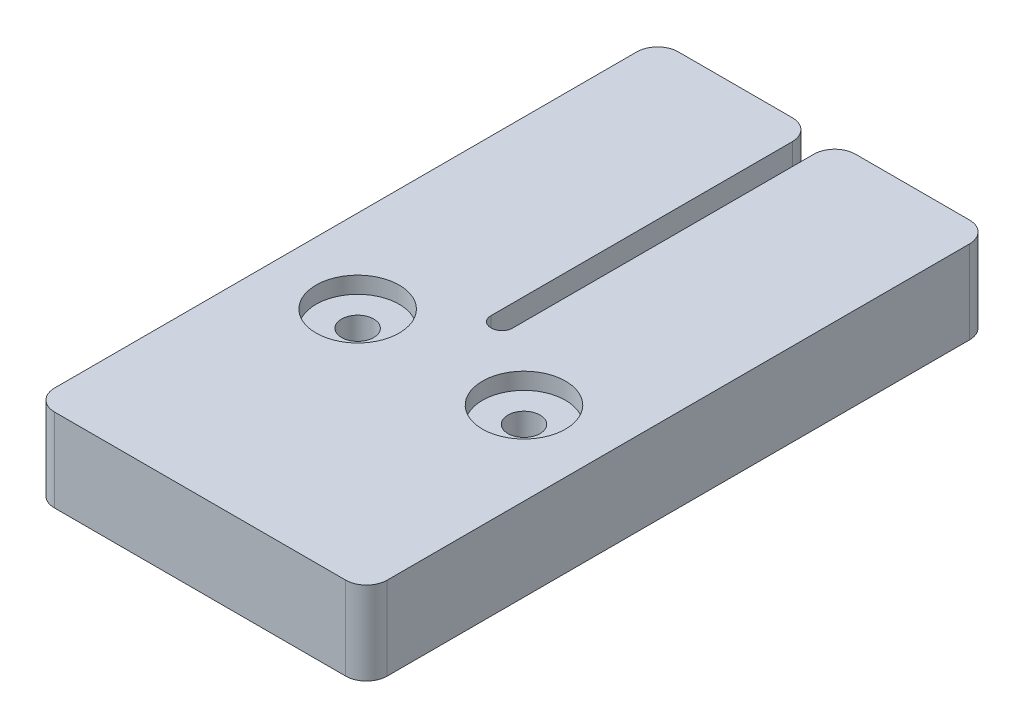
ISO-10303-21;
HEADER;
FILE_DESCRIPTION(('STEP AP214'),'2;1');
FILE_NAME('part.step','',(''),(''),'','','');
FILE_SCHEMA(('AUTOMOTIVE_DESIGN { 1 0 10303 214 1 1 1 1 }'));
ENDSEC;
DATA;
#1=APPLICATION_CONTEXT('core data for automotive mechanical design processes');
#2=APPLICATION_PROTOCOL_DEFINITION('international standard','automotive_design',2000,#1);
#3=PRODUCT_CONTEXT('',#1,'mechanical');
#4=PRODUCT('Part','Part','',(#3));
#5=PRODUCT_RELATED_PRODUCT_CATEGORY('part','',(#4));
#6=PRODUCT_DEFINITION_FORMATION('','',#4);
#7=PRODUCT_DEFINITION_CONTEXT('part definition',#1,'design');
#8=PRODUCT_DEFINITION('design','',#6,#7);
#9=PRODUCT_DEFINITION_SHAPE('','',#8);
#10=(LENGTH_UNIT() NAMED_UNIT(*) SI_UNIT(.MILLI.,.METRE.));
#11=(NAMED_UNIT(*) PLANE_ANGLE_UNIT() SI_UNIT($,.RADIAN.));
#12=(NAMED_UNIT(*) SI_UNIT($,.STERADIAN.) SOLID_ANGLE_UNIT());
#13=UNCERTAINTY_MEASURE_WITH_UNIT(LENGTH_MEASURE(1.E-05),#10,'distance_accuracy_value','');
#14=(GEOMETRIC_REPRESENTATION_CONTEXT(3) GLOBAL_UNCERTAINTY_ASSIGNED_CONTEXT((#13)) GLOBAL_UNIT_ASSIGNED_CONTEXT((#10,
#11,#12)) REPRESENTATION_CONTEXT('',''));
#15=CARTESIAN_POINT('',(0.,0.,0.));
#16=DIRECTION('',(0.,0.,1.));
#17=DIRECTION('',(1.,0.,0.));
#18=AXIS2_PLACEMENT_3D('',#15,#16,#17);
#19=CARTESIAN_POINT('',(12.7,12.7,-36.7538));
#20=DIRECTION('',(0.,-1.,0.));
#21=DIRECTION('',(0.,0.,-1.));
#22=AXIS2_PLACEMENT_3D('',#19,#20,#21);
#23=CYLINDRICAL_SURFACE('',#22,2.45745);
#24=CARTESIAN_POINT('',(12.7,0.,-36.7538));
#25=DIRECTION('',(0.,-1.,0.));
#26=DIRECTION('',(0.,0.,-1.));
#27=AXIS2_PLACEMENT_3D('',#24,#25,#26);
#28=CIRCLE('',#27,2.45745);
#29=CARTESIAN_POINT('',(12.7,0.,-39.21125));
#30=VERTEX_POINT('',#29);
#31=EDGE_CURVE('E297',#30,#30,#28,.T.);
#32=ORIENTED_EDGE('',*,*,#31,.T.);
#33=EDGE_LOOP('',(#32));
#34=FACE_BOUND('',#33,.T.);
#35=CARTESIAN_POINT('',(12.7,10.16,-36.7538));
#36=DIRECTION('',(0.,1.,0.));
#37=DIRECTION('',(0.,0.,1.));
#38=AXIS2_PLACEMENT_3D('',#35,#36,#37);
#39=CIRCLE('',#38,2.45745);
#40=CARTESIAN_POINT('',(12.7,10.16,-34.29635));
#41=VERTEX_POINT('',#40);
#42=EDGE_CURVE('E45',#41,#41,#39,.F.);
#43=ORIENTED_EDGE('',*,*,#42,.F.);
#44=EDGE_LOOP('',(#43));
#45=FACE_BOUND('',#44,.T.);
#46=ADVANCED_FACE('F41',(#34,#45),#23,.F.);
#47=CARTESIAN_POINT('',(-12.7,12.7,-36.7538));
#48=DIRECTION('',(0.,-1.,0.));
#49=DIRECTION('',(0.,0.,-1.));
#50=AXIS2_PLACEMENT_3D('',#47,#48,#49);
#51=CYLINDRICAL_SURFACE('',#50,2.45745);
#52=CARTESIAN_POINT('',(-12.7,0.,-36.7538));
#53=DIRECTION('',(0.,-1.,0.));
#54=DIRECTION('',(0.,0.,-1.));
#55=AXIS2_PLACEMENT_3D('',#52,#53,#54);
#56=CIRCLE('',#55,2.45745);
#57=CARTESIAN_POINT('',(-12.7,0.,-39.21125));
#58=VERTEX_POINT('',#57);
#59=EDGE_CURVE('E316',#58,#58,#56,.T.);
#60=ORIENTED_EDGE('',*,*,#59,.T.);
#61=EDGE_LOOP('',(#60));
#62=FACE_BOUND('',#61,.T.);
#63=CARTESIAN_POINT('',(-12.7,10.16,-36.7538));
#64=DIRECTION('',(0.,1.,0.));
#65=DIRECTION('',(0.,0.,1.));
#66=AXIS2_PLACEMENT_3D('',#63,#64,#65);
#67=CIRCLE('',#66,2.45745);
#68=CARTESIAN_POINT('',(-12.7,10.16,-34.29635));
#69=VERTEX_POINT('',#68);
#70=EDGE_CURVE('E287',#69,#69,#67,.F.);
#71=ORIENTED_EDGE('',*,*,#70,.F.);
#72=EDGE_LOOP('',(#71));
#73=FACE_BOUND('',#72,.T.);
#74=ADVANCED_FACE('F386',(#62,#73),#51,.F.);
#75=CARTESIAN_POINT('',(-25.4,12.7,-95.25));
#76=DIRECTION('',(1.,0.,0.));
#77=DIRECTION('',(0.,0.,-1.));
#78=AXIS2_PLACEMENT_3D('',#75,#76,#77);
#79=PLANE('',#78);
#80=DIRECTION('',(0.,0.,1.));
#81=VECTOR('',#80,1.);
#82=CARTESIAN_POINT('',(-25.4,12.7,-95.25));
#83=LINE('',#82,#81);
#84=CARTESIAN_POINT('',(-25.4,12.7,-92.075));
#85=VERTEX_POINT('',#84);
#86=CARTESIAN_POINT('',(-25.4,12.7,-3.175));
#87=VERTEX_POINT('',#86);
#88=EDGE_CURVE('E196',#85,#87,#83,.T.);
#89=ORIENTED_EDGE('',*,*,#88,.F.);
#90=DIRECTION('',(0.,-1.,0.));
#91=VECTOR('',#90,1.);
#92=CARTESIAN_POINT('',(-25.4,12.7,-92.075));
#93=LINE('',#92,#91);
#94=CARTESIAN_POINT('',(-25.4,0.,-92.075));
#95=VERTEX_POINT('',#94);
#96=EDGE_CURVE('E249',#85,#95,#93,.T.);
#97=ORIENTED_EDGE('',*,*,#96,.T.);
#98=DIRECTION('',(0.,0.,1.));
#99=VECTOR('',#98,1.);
#100=CARTESIAN_POINT('',(-25.4,0.,-95.25));
#101=LINE('',#100,#99);
#102=CARTESIAN_POINT('',(-25.4,0.,-3.175));
#103=VERTEX_POINT('',#102);
#104=EDGE_CURVE('E320',#95,#103,#101,.T.);
#105=ORIENTED_EDGE('',*,*,#104,.T.);
#106=DIRECTION('',(0.,-1.,0.));
#107=VECTOR('',#106,1.);
#108=CARTESIAN_POINT('',(-25.4,12.7,-3.175));
#109=LINE('',#108,#107);
#110=EDGE_CURVE('E246',#103,#87,#109,.F.);
#111=ORIENTED_EDGE('',*,*,#110,.T.);
#112=EDGE_LOOP('',(#89,#97,#105,#111));
#113=FACE_BOUND('',#112,.T.);
#114=ADVANCED_FACE('F392',(#113),#79,.F.);
#115=CARTESIAN_POINT('',(-25.4,12.7,0.));
#116=DIRECTION('',(0.,0.,-1.));
#117=DIRECTION('',(-1.,0.,0.));
#118=AXIS2_PLACEMENT_3D('',#115,#116,#117);
#119=PLANE('',#118);
#120=DIRECTION('',(1.,0.,0.));
#121=VECTOR('',#120,1.);
#122=CARTESIAN_POINT('',(-25.4,12.7,0.));
#123=LINE('',#122,#121);
#124=CARTESIAN_POINT('',(-22.225,12.7,0.));
#125=VERTEX_POINT('',#124);
#126=CARTESIAN_POINT('',(22.225,12.7,0.));
#127=VERTEX_POINT('',#126);
#128=EDGE_CURVE('E327',#125,#127,#123,.T.);
#129=ORIENTED_EDGE('',*,*,#128,.F.);
#130=DIRECTION('',(0.,-1.,0.));
#131=VECTOR('',#130,1.);
#132=CARTESIAN_POINT('',(-22.225,12.7,0.));
#133=LINE('',#132,#131);
#134=CARTESIAN_POINT('',(-22.225,0.,0.));
#135=VERTEX_POINT('',#134);
#136=EDGE_CURVE('E263',#125,#135,#133,.T.);
#137=ORIENTED_EDGE('',*,*,#136,.T.);
#138=DIRECTION('',(1.,0.,0.));
#139=VECTOR('',#138,1.);
#140=CARTESIAN_POINT('',(-25.4,0.,0.));
#141=LINE('',#140,#139);
#142=CARTESIAN_POINT('',(22.225,0.,0.));
#143=VERTEX_POINT('',#142);
#144=EDGE_CURVE('E354',#135,#143,#141,.T.);
#145=ORIENTED_EDGE('',*,*,#144,.T.);
#146=DIRECTION('',(0.,-1.,0.));
#147=VECTOR('',#146,1.);
#148=CARTESIAN_POINT('',(22.225,12.7,0.));
#149=LINE('',#148,#147);
#150=EDGE_CURVE('E260',#143,#127,#149,.F.);
#151=ORIENTED_EDGE('',*,*,#150,.T.);
#152=EDGE_LOOP('',(#129,#137,#145,#151));
#153=FACE_BOUND('',#152,.T.);
#154=ADVANCED_FACE('F383',(#153),#119,.F.);
#155=CARTESIAN_POINT('',(25.4,12.7,0.));
#156=DIRECTION('',(-1.,0.,0.));
#157=DIRECTION('',(0.,0.,1.));
#158=AXIS2_PLACEMENT_3D('',#155,#156,#157);
#159=PLANE('',#158);
#160=DIRECTION('',(0.,0.,-1.));
#161=VECTOR('',#160,1.);
#162=CARTESIAN_POINT('',(25.4,0.,0.));
#163=LINE('',#162,#161);
#164=CARTESIAN_POINT('',(25.4,0.,-3.175));
#165=VERTEX_POINT('',#164);
#166=CARTESIAN_POINT('',(25.4,0.,-92.075));
#167=VERTEX_POINT('',#166);
#168=EDGE_CURVE('E187',#165,#167,#163,.T.);
#169=ORIENTED_EDGE('',*,*,#168,.T.);
#170=DIRECTION('',(0.,-1.,0.));
#171=VECTOR('',#170,1.);
#172=CARTESIAN_POINT('',(25.4,12.7,-92.075));
#173=LINE('',#172,#171);
#174=CARTESIAN_POINT('',(25.4,12.7,-92.075));
#175=VERTEX_POINT('',#174);
#176=EDGE_CURVE('E257',#167,#175,#173,.F.);
#177=ORIENTED_EDGE('',*,*,#176,.T.);
#178=DIRECTION('',(0.,0.,-1.));
#179=VECTOR('',#178,1.);
#180=CARTESIAN_POINT('',(25.4,12.7,0.));
#181=LINE('',#180,#179);
#182=CARTESIAN_POINT('',(25.4,12.7,-3.175));
#183=VERTEX_POINT('',#182);
#184=EDGE_CURVE('E331',#183,#175,#181,.T.);
#185=ORIENTED_EDGE('',*,*,#184,.F.);
#186=DIRECTION('',(0.,-1.,0.));
#187=VECTOR('',#186,1.);
#188=CARTESIAN_POINT('',(25.4,12.7,-3.175));
#189=LINE('',#188,#187);
#190=EDGE_CURVE('E253',#183,#165,#189,.T.);
#191=ORIENTED_EDGE('',*,*,#190,.T.);
#192=EDGE_LOOP('',(#169,#177,#185,#191));
#193=FACE_BOUND('',#192,.T.);
#194=ADVANCED_FACE('F363',(#193),#159,.F.);
#195=CARTESIAN_POINT('',(25.4,12.7,-95.25));
#196=DIRECTION('',(0.,0.,1.));
#197=DIRECTION('',(1.,0.,0.));
#198=AXIS2_PLACEMENT_3D('',#195,#196,#197);
#199=PLANE('',#198);
#200=DIRECTION('',(-1.,0.,0.));
#201=VECTOR('',#200,1.);
#202=CARTESIAN_POINT('',(25.4,0.,-95.25));
#203=LINE('',#202,#201);
#204=CARTESIAN_POINT('',(22.225,0.,-95.25));
#205=VERTEX_POINT('',#204);
#206=CARTESIAN_POINT('',(4.826,0.,-95.25));
#207=VERTEX_POINT('',#206);
#208=EDGE_CURVE('E179',#205,#207,#203,.T.);
#209=ORIENTED_EDGE('',*,*,#208,.T.);
#210=DIRECTION('',(0.,-1.,0.));
#211=VECTOR('',#210,1.);
#212=CARTESIAN_POINT('',(4.826,12.7,-95.25));
#213=LINE('',#212,#211);
#214=CARTESIAN_POINT('',(4.826,12.7,-95.25));
#215=VERTEX_POINT('',#214);
#216=EDGE_CURVE('E162',#207,#215,#213,.F.);
#217=ORIENTED_EDGE('',*,*,#216,.T.);
#218=DIRECTION('',(-1.,0.,0.));
#219=VECTOR('',#218,1.);
#220=CARTESIAN_POINT('',(25.4,12.7,-95.25));
#221=LINE('',#220,#219);
#222=CARTESIAN_POINT('',(22.225,12.7,-95.25));
#223=VERTEX_POINT('',#222);
#224=EDGE_CURVE('E335',#223,#215,#221,.T.);
#225=ORIENTED_EDGE('',*,*,#224,.F.);
#226=DIRECTION('',(0.,-1.,0.));
#227=VECTOR('',#226,1.);
#228=CARTESIAN_POINT('',(22.225,12.7,-95.25));
#229=LINE('',#228,#227);
#230=EDGE_CURVE('E166',#223,#205,#229,.T.);
#231=ORIENTED_EDGE('',*,*,#230,.T.);
#232=EDGE_LOOP('',(#209,#217,#225,#231));
#233=FACE_BOUND('',#232,.T.);
#234=ADVANCED_FACE('F374',(#233),#199,.F.);
#235=CARTESIAN_POINT('',(1.65099999999999,12.7,-44.45));
#236=DIRECTION('',(1.,0.,0.));
#237=DIRECTION('',(0.,0.,-1.));
#238=AXIS2_PLACEMENT_3D('',#235,#236,#237);
#239=PLANE('',#238);
#240=DIRECTION('',(0.,0.,1.));
#241=VECTOR('',#240,1.);
#242=CARTESIAN_POINT('',(1.65099999999999,0.,-44.45));
#243=LINE('',#242,#241);
#244=CARTESIAN_POINT('',(1.651,0.,-92.075));
#245=VERTEX_POINT('',#244);
#246=CARTESIAN_POINT('',(1.65099999999999,0.,-46.0375));
#247=VERTEX_POINT('',#246);
#248=EDGE_CURVE('E170',#245,#247,#243,.T.);
#249=ORIENTED_EDGE('',*,*,#248,.T.);
#250=DIRECTION('',(0.,-1.,0.));
#251=VECTOR('',#250,1.);
#252=CARTESIAN_POINT('',(1.65099999999999,12.7,-46.0375));
#253=LINE('',#252,#251);
#254=CARTESIAN_POINT('',(1.65099999999999,12.7,-46.0375));
#255=VERTEX_POINT('',#254);
#256=EDGE_CURVE('E65',#247,#255,#253,.F.);
#257=ORIENTED_EDGE('',*,*,#256,.T.);
#258=DIRECTION('',(0.,0.,1.));
#259=VECTOR('',#258,1.);
#260=CARTESIAN_POINT('',(1.65099999999999,12.7,-44.45));
#261=LINE('',#260,#259);
#262=CARTESIAN_POINT('',(1.651,12.7,-92.075));
#263=VERTEX_POINT('',#262);
#264=EDGE_CURVE('E171',#263,#255,#261,.T.);
#265=ORIENTED_EDGE('',*,*,#264,.F.);
#266=DIRECTION('',(0.,-1.,0.));
#267=VECTOR('',#266,1.);
#268=CARTESIAN_POINT('',(1.651,12.7,-92.075));
#269=LINE('',#268,#267);
#270=EDGE_CURVE('E161',#263,#245,#269,.T.);
#271=ORIENTED_EDGE('',*,*,#270,.T.);
#272=EDGE_LOOP('',(#249,#257,#265,#271));
#273=FACE_BOUND('',#272,.T.);
#274=ADVANCED_FACE('F169',(#273),#239,.F.);
#275=CARTESIAN_POINT('',(-1.65099999999999,12.7,-44.45));
#276=DIRECTION('',(0.,0.,1.));
#277=DIRECTION('',(1.,0.,0.));
#278=AXIS2_PLACEMENT_3D('',#275,#276,#277);
#279=PLANE('',#278);
#280=DIRECTION('',(-1.,0.,0.));
#281=VECTOR('',#280,1.);
#282=CARTESIAN_POINT('',(-1.65099999999999,0.,-44.45));
#283=LINE('',#282,#281);
#284=CARTESIAN_POINT('',(0.0634999999999939,0.,-44.45));
#285=VERTEX_POINT('',#284);
#286=CARTESIAN_POINT('',(-0.0634999999999939,0.,-44.45));
#287=VERTEX_POINT('',#286);
#288=EDGE_CURVE('E178',#285,#287,#283,.T.);
#289=ORIENTED_EDGE('',*,*,#288,.T.);
#290=DIRECTION('',(0.,-1.,0.));
#291=VECTOR('',#290,1.);
#292=CARTESIAN_POINT('',(-0.0634999999999939,12.7,-44.45));
#293=LINE('',#292,#291);
#294=CARTESIAN_POINT('',(-0.0634999999999939,12.7,-44.45));
#295=VERTEX_POINT('',#294);
#296=EDGE_CURVE('E275',#287,#295,#293,.F.);
#297=ORIENTED_EDGE('',*,*,#296,.T.);
#298=DIRECTION('',(-1.,0.,0.));
#299=VECTOR('',#298,1.);
#300=CARTESIAN_POINT('',(-1.65099999999999,12.7,-44.45));
#301=LINE('',#300,#299);
#302=CARTESIAN_POINT('',(0.0634999999999939,12.7,-44.45));
#303=VERTEX_POINT('',#302);
#304=EDGE_CURVE('E341',#303,#295,#301,.T.);
#305=ORIENTED_EDGE('',*,*,#304,.F.);
#306=DIRECTION('',(0.,-1.,0.));
#307=VECTOR('',#306,1.);
#308=CARTESIAN_POINT('',(0.0634999999999939,0.,-44.45));
#309=LINE('',#308,#307);
#310=EDGE_CURVE('E271',#303,#285,#309,.T.);
#311=ORIENTED_EDGE('',*,*,#310,.T.);
#312=EDGE_LOOP('',(#289,#297,#305,#311));
#313=FACE_BOUND('',#312,.T.);
#314=ADVANCED_FACE('F381',(#313),#279,.F.);
#315=CARTESIAN_POINT('',(-1.651,12.7,-95.25));
#316=DIRECTION('',(-1.,0.,0.));
#317=DIRECTION('',(0.,0.,1.));
#318=AXIS2_PLACEMENT_3D('',#315,#316,#317);
#319=PLANE('',#318);
#320=DIRECTION('',(0.,0.,-1.));
#321=VECTOR('',#320,1.);
#322=CARTESIAN_POINT('',(-1.651,12.7,-95.25));
#323=LINE('',#322,#321);
#324=CARTESIAN_POINT('',(-1.65099999999999,12.7,-46.0375));
#325=VERTEX_POINT('',#324);
#326=CARTESIAN_POINT('',(-1.651,12.7,-92.075));
#327=VERTEX_POINT('',#326);
#328=EDGE_CURVE('E345',#325,#327,#323,.T.);
#329=ORIENTED_EDGE('',*,*,#328,.F.);
#330=DIRECTION('',(0.,-1.,0.));
#331=VECTOR('',#330,1.);
#332=CARTESIAN_POINT('',(-1.65099999999999,0.,-46.0375));
#333=LINE('',#332,#331);
#334=CARTESIAN_POINT('',(-1.65099999999999,0.,-46.0375));
#335=VERTEX_POINT('',#334);
#336=EDGE_CURVE('E267',#325,#335,#333,.T.);
#337=ORIENTED_EDGE('',*,*,#336,.T.);
#338=DIRECTION('',(0.,0.,-1.));
#339=VECTOR('',#338,1.);
#340=CARTESIAN_POINT('',(-1.651,0.,-95.25));
#341=LINE('',#340,#339);
#342=CARTESIAN_POINT('',(-1.651,0.,-92.075));
#343=VERTEX_POINT('',#342);
#344=EDGE_CURVE('E185',#335,#343,#341,.T.);
#345=ORIENTED_EDGE('',*,*,#344,.T.);
#346=DIRECTION('',(0.,-1.,0.));
#347=VECTOR('',#346,1.);
#348=CARTESIAN_POINT('',(-1.651,12.7,-92.075));
#349=LINE('',#348,#347);
#350=EDGE_CURVE('E242',#343,#327,#349,.F.);
#351=ORIENTED_EDGE('',*,*,#350,.T.);
#352=EDGE_LOOP('',(#329,#337,#345,#351));
#353=FACE_BOUND('',#352,.T.);
#354=ADVANCED_FACE('F407',(#353),#319,.F.);
#355=CARTESIAN_POINT('',(-1.651,12.7,-95.25));
#356=DIRECTION('',(0.,0.,1.));
#357=DIRECTION('',(1.,0.,0.));
#358=AXIS2_PLACEMENT_3D('',#355,#356,#357);
#359=PLANE('',#358);
#360=DIRECTION('',(-1.,0.,0.));
#361=VECTOR('',#360,1.);
#362=CARTESIAN_POINT('',(-1.651,12.7,-95.25));
#363=LINE('',#362,#361);
#364=CARTESIAN_POINT('',(-4.826,12.7,-95.25));
#365=VERTEX_POINT('',#364);
#366=CARTESIAN_POINT('',(-22.225,12.7,-95.25));
#367=VERTEX_POINT('',#366);
#368=EDGE_CURVE('E174',#365,#367,#363,.T.);
#369=ORIENTED_EDGE('',*,*,#368,.F.);
#370=DIRECTION('',(0.,-1.,0.));
#371=VECTOR('',#370,1.);
#372=CARTESIAN_POINT('',(-4.826,12.7,-95.25));
#373=LINE('',#372,#371);
#374=CARTESIAN_POINT('',(-4.826,0.,-95.25));
#375=VERTEX_POINT('',#374);
#376=EDGE_CURVE('E238',#365,#375,#373,.T.);
#377=ORIENTED_EDGE('',*,*,#376,.T.);
#378=DIRECTION('',(-1.,0.,0.));
#379=VECTOR('',#378,1.);
#380=CARTESIAN_POINT('',(-1.651,0.,-95.25));
#381=LINE('',#380,#379);
#382=CARTESIAN_POINT('',(-22.225,0.,-95.25));
#383=VERTEX_POINT('',#382);
#384=EDGE_CURVE('E193',#375,#383,#381,.T.);
#385=ORIENTED_EDGE('',*,*,#384,.T.);
#386=DIRECTION('',(0.,-1.,0.));
#387=VECTOR('',#386,1.);
#388=CARTESIAN_POINT('',(-22.225,12.7,-95.25));
#389=LINE('',#388,#387);
#390=EDGE_CURVE('E235',#383,#367,#389,.F.);
#391=ORIENTED_EDGE('',*,*,#390,.T.);
#392=EDGE_LOOP('',(#369,#377,#385,#391));
#393=FACE_BOUND('',#392,.T.);
#394=ADVANCED_FACE('F400',(#393),#359,.F.);
#395=CARTESIAN_POINT('',(0.,12.7,0.));
#396=DIRECTION('',(0.,1.,0.));
#397=DIRECTION('',(0.,0.,1.));
#398=AXIS2_PLACEMENT_3D('',#395,#396,#397);
#399=PLANE('',#398);
#400=CARTESIAN_POINT('',(12.7,12.7,-36.7538));
#401=DIRECTION('',(0.,1.,0.));
#402=DIRECTION('',(0.,0.,1.));
#403=AXIS2_PLACEMENT_3D('',#400,#401,#402);
#404=CIRCLE('',#403,6.35);
#405=CARTESIAN_POINT('',(12.7,12.7,-30.4038));
#406=VERTEX_POINT('',#405);
#407=EDGE_CURVE('E299',#406,#406,#404,.T.);
#408=ORIENTED_EDGE('',*,*,#407,.F.);
#409=EDGE_LOOP('',(#408));
#410=FACE_BOUND('',#409,.T.);
#411=CARTESIAN_POINT('',(-12.7,12.7,-36.7538));
#412=DIRECTION('',(0.,1.,0.));
#413=DIRECTION('',(0.,0.,1.));
#414=AXIS2_PLACEMENT_3D('',#411,#412,#413);
#415=CIRCLE('',#414,6.35);
#416=CARTESIAN_POINT('',(-12.7,12.7,-30.4038));
#417=VERTEX_POINT('',#416);
#418=EDGE_CURVE('E312',#417,#417,#415,.T.);
#419=ORIENTED_EDGE('',*,*,#418,.F.);
#420=EDGE_LOOP('',(#419));
#421=FACE_BOUND('',#420,.T.);
#422=ORIENTED_EDGE('',*,*,#224,.T.);
#423=CARTESIAN_POINT('',(4.826,12.7,-92.075));
#424=DIRECTION('',(0.,1.,0.));
#425=DIRECTION('',(0.,0.,1.));
#426=AXIS2_PLACEMENT_3D('',#423,#424,#425);
#427=CIRCLE('',#426,3.175);
#428=EDGE_CURVE('E232',#215,#263,#427,.T.);
#429=ORIENTED_EDGE('',*,*,#428,.T.);
#430=ORIENTED_EDGE('',*,*,#264,.T.);
#431=CARTESIAN_POINT('',(0.0634999999999939,12.7,-46.0375));
#432=DIRECTION('',(0.,1.,0.));
#433=DIRECTION('',(0.,0.,1.));
#434=AXIS2_PLACEMENT_3D('',#431,#432,#433);
#435=CIRCLE('',#434,1.5875);
#436=EDGE_CURVE('E11',#255,#303,#435,.F.);
#437=ORIENTED_EDGE('',*,*,#436,.T.);
#438=ORIENTED_EDGE('',*,*,#304,.T.);
#439=CARTESIAN_POINT('',(-0.0634999999999939,12.7,-46.0375));
#440=DIRECTION('',(0.,1.,0.));
#441=DIRECTION('',(0.,0.,1.));
#442=AXIS2_PLACEMENT_3D('',#439,#440,#441);
#443=CIRCLE('',#442,1.5875);
#444=EDGE_CURVE('E283',#295,#325,#443,.F.);
#445=ORIENTED_EDGE('',*,*,#444,.T.);
#446=ORIENTED_EDGE('',*,*,#328,.T.);
#447=CARTESIAN_POINT('',(-4.826,12.7,-92.075));
#448=DIRECTION('',(0.,1.,0.));
#449=DIRECTION('',(0.,0.,1.));
#450=AXIS2_PLACEMENT_3D('',#447,#448,#449);
#451=CIRCLE('',#450,3.175);
#452=EDGE_CURVE('E229',#327,#365,#451,.T.);
#453=ORIENTED_EDGE('',*,*,#452,.T.);
#454=ORIENTED_EDGE('',*,*,#368,.T.);
#455=CARTESIAN_POINT('',(-22.225,12.7,-92.075));
#456=DIRECTION('',(0.,1.,0.));
#457=DIRECTION('',(0.,0.,1.));
#458=AXIS2_PLACEMENT_3D('',#455,#456,#457);
#459=CIRCLE('',#458,3.175);
#460=EDGE_CURVE('E226',#367,#85,#459,.T.);
#461=ORIENTED_EDGE('',*,*,#460,.T.);
#462=ORIENTED_EDGE('',*,*,#88,.T.);
#463=CARTESIAN_POINT('',(-22.225,12.7,-3.175));
#464=DIRECTION('',(0.,1.,0.));
#465=DIRECTION('',(0.,0.,1.));
#466=AXIS2_PLACEMENT_3D('',#463,#464,#465);
#467=CIRCLE('',#466,3.175);
#468=EDGE_CURVE('E220',#87,#125,#467,.T.);
#469=ORIENTED_EDGE('',*,*,#468,.T.);
#470=ORIENTED_EDGE('',*,*,#128,.T.);
#471=CARTESIAN_POINT('',(22.225,12.7,-3.175));
#472=DIRECTION('',(0.,1.,0.));
#473=DIRECTION('',(0.,0.,1.));
#474=AXIS2_PLACEMENT_3D('',#471,#472,#473);
#475=CIRCLE('',#474,3.175);
#476=EDGE_CURVE('E217',#127,#183,#475,.T.);
#477=ORIENTED_EDGE('',*,*,#476,.T.);
#478=ORIENTED_EDGE('',*,*,#184,.T.);
#479=CARTESIAN_POINT('',(22.225,12.7,-92.075));
#480=DIRECTION('',(0.,1.,0.));
#481=DIRECTION('',(0.,0.,1.));
#482=AXIS2_PLACEMENT_3D('',#479,#480,#481);
#483=CIRCLE('',#482,3.175);
#484=EDGE_CURVE('E223',#175,#223,#483,.T.);
#485=ORIENTED_EDGE('',*,*,#484,.T.);
#486=EDGE_LOOP('',(#422,#429,#430,#437,#438,#445,#446,#453,#454,#461,#462,#469,#470,#477,#478,#485));
#487=FACE_BOUND('',#486,.T.);
#488=ADVANCED_FACE('F372',(#410,#421,#487),#399,.T.);
#489=CARTESIAN_POINT('',(0.,0.,0.));
#490=DIRECTION('',(0.,1.,0.));
#491=DIRECTION('',(0.,0.,1.));
#492=AXIS2_PLACEMENT_3D('',#489,#490,#491);
#493=PLANE('',#492);
#494=ORIENTED_EDGE('',*,*,#59,.F.);
#495=EDGE_LOOP('',(#494));
#496=FACE_BOUND('',#495,.T.);
#497=ORIENTED_EDGE('',*,*,#31,.F.);
#498=EDGE_LOOP('',(#497));
#499=FACE_BOUND('',#498,.T.);
#500=ORIENTED_EDGE('',*,*,#248,.F.);
#501=CARTESIAN_POINT('',(4.826,0.,-92.075));
#502=DIRECTION('',(0.,1.,0.));
#503=DIRECTION('',(0.,0.,1.));
#504=AXIS2_PLACEMENT_3D('',#501,#502,#503);
#505=CIRCLE('',#504,3.175);
#506=EDGE_CURVE('E157',#245,#207,#505,.F.);
#507=ORIENTED_EDGE('',*,*,#506,.T.);
#508=ORIENTED_EDGE('',*,*,#208,.F.);
#509=CARTESIAN_POINT('',(22.225,0.,-92.075));
#510=DIRECTION('',(0.,1.,0.));
#511=DIRECTION('',(0.,0.,1.));
#512=AXIS2_PLACEMENT_3D('',#509,#510,#511);
#513=CIRCLE('',#512,3.175);
#514=EDGE_CURVE('E203',#205,#167,#513,.F.);
#515=ORIENTED_EDGE('',*,*,#514,.T.);
#516=ORIENTED_EDGE('',*,*,#168,.F.);
#517=CARTESIAN_POINT('',(22.225,0.,-3.175));
#518=DIRECTION('',(0.,1.,0.));
#519=DIRECTION('',(0.,0.,1.));
#520=AXIS2_PLACEMENT_3D('',#517,#518,#519);
#521=CIRCLE('',#520,3.175);
#522=EDGE_CURVE('E173',#165,#143,#521,.F.);
#523=ORIENTED_EDGE('',*,*,#522,.T.);
#524=ORIENTED_EDGE('',*,*,#144,.F.);
#525=CARTESIAN_POINT('',(-22.225,0.,-3.175));
#526=DIRECTION('',(0.,1.,0.));
#527=DIRECTION('',(0.,0.,1.));
#528=AXIS2_PLACEMENT_3D('',#525,#526,#527);
#529=CIRCLE('',#528,3.175);
#530=EDGE_CURVE('E200',#135,#103,#529,.F.);
#531=ORIENTED_EDGE('',*,*,#530,.T.);
#532=ORIENTED_EDGE('',*,*,#104,.F.);
#533=CARTESIAN_POINT('',(-22.225,0.,-92.075));
#534=DIRECTION('',(0.,1.,0.));
#535=DIRECTION('',(0.,0.,1.));
#536=AXIS2_PLACEMENT_3D('',#533,#534,#535);
#537=CIRCLE('',#536,3.175);
#538=EDGE_CURVE('E206',#95,#383,#537,.F.);
#539=ORIENTED_EDGE('',*,*,#538,.T.);
#540=ORIENTED_EDGE('',*,*,#384,.F.);
#541=CARTESIAN_POINT('',(-4.826,0.,-92.075));
#542=DIRECTION('',(0.,1.,0.));
#543=DIRECTION('',(0.,0.,1.));
#544=AXIS2_PLACEMENT_3D('',#541,#542,#543);
#545=CIRCLE('',#544,3.175);
#546=EDGE_CURVE('E167',#375,#343,#545,.F.);
#547=ORIENTED_EDGE('',*,*,#546,.T.);
#548=ORIENTED_EDGE('',*,*,#344,.F.);
#549=CARTESIAN_POINT('',(-0.0634999999999939,0.,-46.0375));
#550=DIRECTION('',(0.,1.,0.));
#551=DIRECTION('',(0.,0.,1.));
#552=AXIS2_PLACEMENT_3D('',#549,#550,#551);
#553=CIRCLE('',#552,1.5875);
#554=EDGE_CURVE('E280',#335,#287,#553,.T.);
#555=ORIENTED_EDGE('',*,*,#554,.T.);
#556=ORIENTED_EDGE('',*,*,#288,.F.);
#557=CARTESIAN_POINT('',(0.0634999999999939,0.,-46.0375));
#558=DIRECTION('',(0.,1.,0.));
#559=DIRECTION('',(0.,0.,1.));
#560=AXIS2_PLACEMENT_3D('',#557,#558,#559);
#561=CIRCLE('',#560,1.5875);
#562=EDGE_CURVE('E51',#285,#247,#561,.T.);
#563=ORIENTED_EDGE('',*,*,#562,.T.);
#564=EDGE_LOOP('',(#500,#507,#508,#515,#516,#523,#524,#531,#532,#539,#540,#547,#548,#555,#556,#563));
#565=FACE_BOUND('',#564,.T.);
#566=ADVANCED_FACE('F176',(#496,#499,#565),#493,.F.);
#567=CARTESIAN_POINT('',(4.826,12.7,-92.075));
#568=DIRECTION('',(0.,-1.,0.));
#569=DIRECTION('',(0.,0.,-1.));
#570=AXIS2_PLACEMENT_3D('',#567,#568,#569);
#571=CYLINDRICAL_SURFACE('',#570,3.175);
#572=ORIENTED_EDGE('',*,*,#428,.F.);
#573=ORIENTED_EDGE('',*,*,#216,.F.);
#574=ORIENTED_EDGE('',*,*,#506,.F.);
#575=ORIENTED_EDGE('',*,*,#270,.F.);
#576=EDGE_LOOP('',(#572,#573,#574,#575));
#577=FACE_BOUND('',#576,.T.);
#578=ADVANCED_FACE('F160',(#577),#571,.T.);
#579=CARTESIAN_POINT('',(-4.826,12.7,-92.075));
#580=DIRECTION('',(0.,-1.,0.));
#581=DIRECTION('',(0.,0.,-1.));
#582=AXIS2_PLACEMENT_3D('',#579,#580,#581);
#583=CYLINDRICAL_SURFACE('',#582,3.175);
#584=ORIENTED_EDGE('',*,*,#452,.F.);
#585=ORIENTED_EDGE('',*,*,#350,.F.);
#586=ORIENTED_EDGE('',*,*,#546,.F.);
#587=ORIENTED_EDGE('',*,*,#376,.F.);
#588=EDGE_LOOP('',(#584,#585,#586,#587));
#589=FACE_BOUND('',#588,.T.);
#590=ADVANCED_FACE('F429',(#589),#583,.T.);
#591=CARTESIAN_POINT('',(-22.225,12.7,-92.075));
#592=DIRECTION('',(0.,-1.,0.));
#593=DIRECTION('',(0.,0.,-1.));
#594=AXIS2_PLACEMENT_3D('',#591,#592,#593);
#595=CYLINDRICAL_SURFACE('',#594,3.175);
#596=ORIENTED_EDGE('',*,*,#460,.F.);
#597=ORIENTED_EDGE('',*,*,#390,.F.);
#598=ORIENTED_EDGE('',*,*,#538,.F.);
#599=ORIENTED_EDGE('',*,*,#96,.F.);
#600=EDGE_LOOP('',(#596,#597,#598,#599));
#601=FACE_BOUND('',#600,.T.);
#602=ADVANCED_FACE('F435',(#601),#595,.T.);
#603=CARTESIAN_POINT('',(22.225,12.7,-92.075));
#604=DIRECTION('',(0.,-1.,0.));
#605=DIRECTION('',(0.,0.,-1.));
#606=AXIS2_PLACEMENT_3D('',#603,#604,#605);
#607=CYLINDRICAL_SURFACE('',#606,3.175);
#608=ORIENTED_EDGE('',*,*,#484,.F.);
#609=ORIENTED_EDGE('',*,*,#176,.F.);
#610=ORIENTED_EDGE('',*,*,#514,.F.);
#611=ORIENTED_EDGE('',*,*,#230,.F.);
#612=EDGE_LOOP('',(#608,#609,#610,#611));
#613=FACE_BOUND('',#612,.T.);
#614=ADVANCED_FACE('F368',(#613),#607,.T.);
#615=CARTESIAN_POINT('',(-22.225,12.7,-3.175));
#616=DIRECTION('',(0.,-1.,0.));
#617=DIRECTION('',(0.,0.,-1.));
#618=AXIS2_PLACEMENT_3D('',#615,#616,#617);
#619=CYLINDRICAL_SURFACE('',#618,3.175);
#620=ORIENTED_EDGE('',*,*,#468,.F.);
#621=ORIENTED_EDGE('',*,*,#110,.F.);
#622=ORIENTED_EDGE('',*,*,#530,.F.);
#623=ORIENTED_EDGE('',*,*,#136,.F.);
#624=EDGE_LOOP('',(#620,#621,#622,#623));
#625=FACE_BOUND('',#624,.T.);
#626=ADVANCED_FACE('F443',(#625),#619,.T.);
#627=CARTESIAN_POINT('',(22.225,12.7,-3.175));
#628=DIRECTION('',(0.,-1.,0.));
#629=DIRECTION('',(0.,0.,-1.));
#630=AXIS2_PLACEMENT_3D('',#627,#628,#629);
#631=CYLINDRICAL_SURFACE('',#630,3.175);
#632=ORIENTED_EDGE('',*,*,#476,.F.);
#633=ORIENTED_EDGE('',*,*,#150,.F.);
#634=ORIENTED_EDGE('',*,*,#522,.F.);
#635=ORIENTED_EDGE('',*,*,#190,.F.);
#636=EDGE_LOOP('',(#632,#633,#634,#635));
#637=FACE_BOUND('',#636,.T.);
#638=ADVANCED_FACE('F451',(#637),#631,.T.);
#639=CARTESIAN_POINT('',(-0.0634999999999939,12.7,-46.0375));
#640=DIRECTION('',(0.,1.,0.));
#641=DIRECTION('',(0.,0.,1.));
#642=AXIS2_PLACEMENT_3D('',#639,#640,#641);
#643=CYLINDRICAL_SURFACE('',#642,1.5875);
#644=ORIENTED_EDGE('',*,*,#444,.F.);
#645=ORIENTED_EDGE('',*,*,#296,.F.);
#646=ORIENTED_EDGE('',*,*,#554,.F.);
#647=ORIENTED_EDGE('',*,*,#336,.F.);
#648=EDGE_LOOP('',(#644,#645,#646,#647));
#649=FACE_BOUND('',#648,.T.);
#650=ADVANCED_FACE('F421',(#649),#643,.F.);
#651=CARTESIAN_POINT('',(0.0634999999999939,12.7,-46.0375));
#652=DIRECTION('',(0.,1.,0.));
#653=DIRECTION('',(0.,0.,1.));
#654=AXIS2_PLACEMENT_3D('',#651,#652,#653);
#655=CYLINDRICAL_SURFACE('',#654,1.5875);
#656=ORIENTED_EDGE('',*,*,#436,.F.);
#657=ORIENTED_EDGE('',*,*,#256,.F.);
#658=ORIENTED_EDGE('',*,*,#562,.F.);
#659=ORIENTED_EDGE('',*,*,#310,.F.);
#660=EDGE_LOOP('',(#656,#657,#658,#659));
#661=FACE_BOUND('',#660,.T.);
#662=ADVANCED_FACE('F43',(#661),#655,.F.);
#663=CARTESIAN_POINT('',(-12.7,10.16,-36.7538));
#664=DIRECTION('',(0.,1.,0.));
#665=DIRECTION('',(0.,0.,1.));
#666=AXIS2_PLACEMENT_3D('',#663,#664,#665);
#667=PLANE('',#666);
#668=CARTESIAN_POINT('',(-12.7,10.16,-36.7538));
#669=DIRECTION('',(0.,1.,0.));
#670=DIRECTION('',(0.,0.,1.));
#671=AXIS2_PLACEMENT_3D('',#668,#669,#670);
#672=CIRCLE('',#671,6.35);
#673=CARTESIAN_POINT('',(-12.7,10.16,-30.4038));
#674=VERTEX_POINT('',#673);
#675=EDGE_CURVE('E306',#674,#674,#672,.T.);
#676=ORIENTED_EDGE('',*,*,#675,.T.);
#677=EDGE_LOOP('',(#676));
#678=FACE_BOUND('',#677,.T.);
#679=ORIENTED_EDGE('',*,*,#70,.T.);
#680=EDGE_LOOP('',(#679));
#681=FACE_BOUND('',#680,.T.);
#682=ADVANCED_FACE('F556',(#678,#681),#667,.T.);
#683=CARTESIAN_POINT('',(-12.7,10.16,-36.7538));
#684=DIRECTION('',(0.,1.,0.));
#685=DIRECTION('',(0.,0.,1.));
#686=AXIS2_PLACEMENT_3D('',#683,#684,#685);
#687=CYLINDRICAL_SURFACE('',#686,6.35);
#688=ORIENTED_EDGE('',*,*,#675,.F.);
#689=EDGE_LOOP('',(#688));
#690=FACE_BOUND('',#689,.T.);
#691=ORIENTED_EDGE('',*,*,#418,.T.);
#692=EDGE_LOOP('',(#691));
#693=FACE_BOUND('',#692,.T.);
#694=ADVANCED_FACE('F585',(#690,#693),#687,.F.);
#695=CARTESIAN_POINT('',(12.7,10.16,-36.7538));
#696=DIRECTION('',(0.,1.,0.));
#697=DIRECTION('',(0.,0.,1.));
#698=AXIS2_PLACEMENT_3D('',#695,#696,#697);
#699=PLANE('',#698);
#700=CARTESIAN_POINT('',(12.7,10.16,-36.7538));
#701=DIRECTION('',(0.,1.,0.));
#702=DIRECTION('',(0.,0.,1.));
#703=AXIS2_PLACEMENT_3D('',#700,#701,#702);
#704=CIRCLE('',#703,6.35);
#705=CARTESIAN_POINT('',(12.7,10.16,-30.4038));
#706=VERTEX_POINT('',#705);
#707=EDGE_CURVE('E290',#706,#706,#704,.T.);
#708=ORIENTED_EDGE('',*,*,#707,.T.);
#709=EDGE_LOOP('',(#708));
#710=FACE_BOUND('',#709,.T.);
#711=ORIENTED_EDGE('',*,*,#42,.T.);
#712=EDGE_LOOP('',(#711));
#713=FACE_BOUND('',#712,.T.);
#714=ADVANCED_FACE('F595',(#710,#713),#699,.T.);
#715=CARTESIAN_POINT('',(12.7,10.16,-36.7538));
#716=DIRECTION('',(0.,1.,0.));
#717=DIRECTION('',(0.,0.,1.));
#718=AXIS2_PLACEMENT_3D('',#715,#716,#717);
#719=CYLINDRICAL_SURFACE('',#718,6.35);
#720=ORIENTED_EDGE('',*,*,#707,.F.);
#721=EDGE_LOOP('',(#720));
#722=FACE_BOUND('',#721,.T.);
#723=ORIENTED_EDGE('',*,*,#407,.T.);
#724=EDGE_LOOP('',(#723));
#725=FACE_BOUND('',#724,.T.);
#726=ADVANCED_FACE('F604',(#722,#725),#719,.F.);
#727=CLOSED_SHELL('',(#46,#74,#114,#154,#194,#234,#274,#314,#354,#394,#488,#566,#578,#590,#602,
#614,#626,#638,#650,#662,#682,#694,#714,#726));
#728=MANIFOLD_SOLID_BREP('B2',#727);
#729=ADVANCED_BREP_SHAPE_REPRESENTATION('',(#18,#728),#14);
#730=SHAPE_DEFINITION_REPRESENTATION(#9,#729);
ENDSEC;
END-ISO-10303-21;
